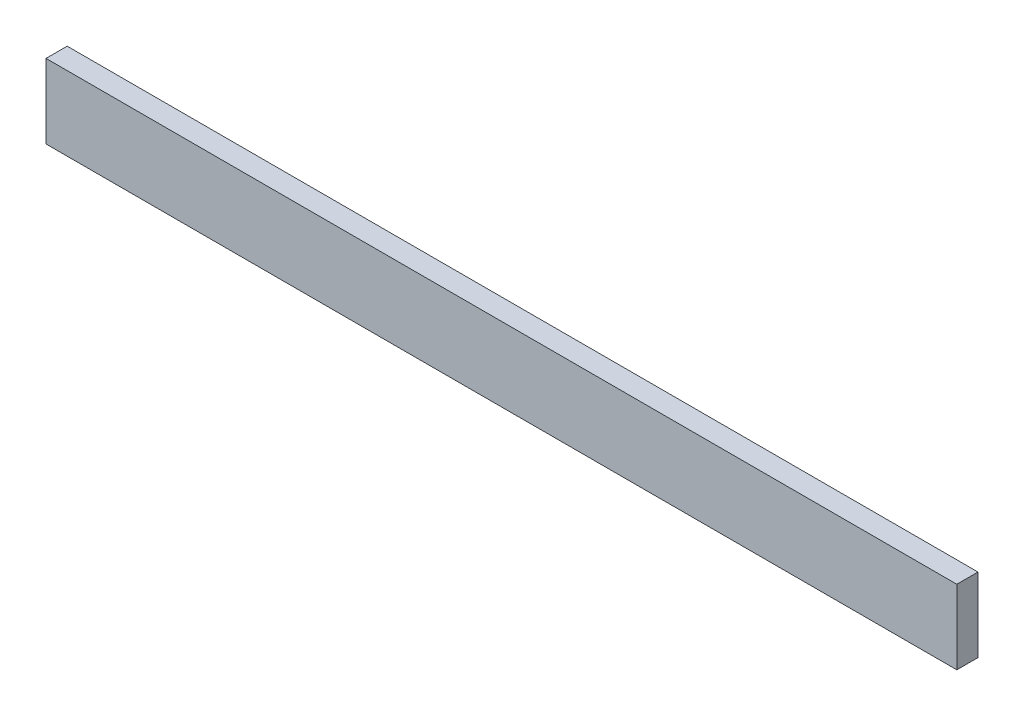
ISO-10303-21;
HEADER;
FILE_DESCRIPTION(('STEP AP214'),'2;1');
FILE_NAME('part.step','',(''),(''),'','','');
FILE_SCHEMA(('AUTOMOTIVE_DESIGN { 1 0 10303 214 1 1 1 1 }'));
ENDSEC;
DATA;
#1=APPLICATION_CONTEXT('core data for automotive mechanical design processes');
#2=APPLICATION_PROTOCOL_DEFINITION('international standard','automotive_design',2000,#1);
#3=PRODUCT_CONTEXT('',#1,'mechanical');
#4=PRODUCT('Part','Part','',(#3));
#5=PRODUCT_RELATED_PRODUCT_CATEGORY('part','',(#4));
#6=PRODUCT_DEFINITION_FORMATION('','',#4);
#7=PRODUCT_DEFINITION_CONTEXT('part definition',#1,'design');
#8=PRODUCT_DEFINITION('design','',#6,#7);
#9=PRODUCT_DEFINITION_SHAPE('','',#8);
#10=(LENGTH_UNIT() NAMED_UNIT(*) SI_UNIT(.MILLI.,.METRE.));
#11=(NAMED_UNIT(*) PLANE_ANGLE_UNIT() SI_UNIT($,.RADIAN.));
#12=(NAMED_UNIT(*) SI_UNIT($,.STERADIAN.) SOLID_ANGLE_UNIT());
#13=UNCERTAINTY_MEASURE_WITH_UNIT(LENGTH_MEASURE(1.E-05),#10,'distance_accuracy_value','');
#14=(GEOMETRIC_REPRESENTATION_CONTEXT(3) GLOBAL_UNCERTAINTY_ASSIGNED_CONTEXT((#13)) GLOBAL_UNIT_ASSIGNED_CONTEXT((#10,
#11,#12)) REPRESENTATION_CONTEXT('',''));
#15=CARTESIAN_POINT('',(0.,0.,0.));
#16=DIRECTION('',(0.,0.,1.));
#17=DIRECTION('',(1.,0.,0.));
#18=AXIS2_PLACEMENT_3D('',#15,#16,#17);
#19=CARTESIAN_POINT('',(85.9999999999999,7.,-4.));
#20=DIRECTION('',(1.,0.,0.));
#21=DIRECTION('',(0.,0.,-1.));
#22=AXIS2_PLACEMENT_3D('',#19,#20,#21);
#23=PLANE('',#22);
#24=DIRECTION('',(0.,1.,0.));
#25=VECTOR('',#24,1.);
#26=CARTESIAN_POINT('',(85.9999999999999,7.,0.));
#27=LINE('',#26,#25);
#28=CARTESIAN_POINT('',(85.9999999999999,-7.,0.));
#29=VERTEX_POINT('',#28);
#30=CARTESIAN_POINT('',(85.9999999999999,7.,0.));
#31=VERTEX_POINT('',#30);
#32=EDGE_CURVE('E101',#29,#31,#27,.T.);
#33=ORIENTED_EDGE('',*,*,#32,.F.);
#34=DIRECTION('',(0.,0.,1.));
#35=VECTOR('',#34,1.);
#36=CARTESIAN_POINT('',(85.9999999999999,-7.,-4.));
#37=LINE('',#36,#35);
#38=CARTESIAN_POINT('',(85.9999999999999,-7.,-4.));
#39=VERTEX_POINT('',#38);
#40=EDGE_CURVE('E11',#39,#29,#37,.T.);
#41=ORIENTED_EDGE('',*,*,#40,.F.);
#42=DIRECTION('',(0.,1.,0.));
#43=VECTOR('',#42,1.);
#44=CARTESIAN_POINT('',(85.9999999999999,7.,-4.));
#45=LINE('',#44,#43);
#46=CARTESIAN_POINT('',(85.9999999999999,7.,-4.));
#47=VERTEX_POINT('',#46);
#48=EDGE_CURVE('E95',#39,#47,#45,.T.);
#49=ORIENTED_EDGE('',*,*,#48,.T.);
#50=DIRECTION('',(0.,0.,1.));
#51=VECTOR('',#50,1.);
#52=CARTESIAN_POINT('',(85.9999999999999,7.,-4.));
#53=LINE('',#52,#51);
#54=EDGE_CURVE('E40',#47,#31,#53,.T.);
#55=ORIENTED_EDGE('',*,*,#54,.T.);
#56=EDGE_LOOP('',(#33,#41,#49,#55));
#57=FACE_BOUND('',#56,.T.);
#58=ADVANCED_FACE('F37',(#57),#23,.T.);
#59=CARTESIAN_POINT('',(-86.,-7.,-4.));
#60=DIRECTION('',(0.,-1.,0.));
#61=DIRECTION('',(0.,0.,-1.));
#62=AXIS2_PLACEMENT_3D('',#59,#60,#61);
#63=PLANE('',#62);
#64=DIRECTION('',(1.,0.,0.));
#65=VECTOR('',#64,1.);
#66=CARTESIAN_POINT('',(-86.,-7.,0.));
#67=LINE('',#66,#65);
#68=CARTESIAN_POINT('',(-86.,-7.,0.));
#69=VERTEX_POINT('',#68);
#70=EDGE_CURVE('E97',#69,#29,#67,.T.);
#71=ORIENTED_EDGE('',*,*,#70,.F.);
#72=DIRECTION('',(0.,0.,1.));
#73=VECTOR('',#72,1.);
#74=CARTESIAN_POINT('',(-86.,-7.,-4.));
#75=LINE('',#74,#73);
#76=CARTESIAN_POINT('',(-86.,-7.,-4.));
#77=VERTEX_POINT('',#76);
#78=EDGE_CURVE('E46',#77,#69,#75,.T.);
#79=ORIENTED_EDGE('',*,*,#78,.F.);
#80=DIRECTION('',(1.,0.,0.));
#81=VECTOR('',#80,1.);
#82=CARTESIAN_POINT('',(-86.,-7.,-4.));
#83=LINE('',#82,#81);
#84=EDGE_CURVE('E92',#77,#39,#83,.T.);
#85=ORIENTED_EDGE('',*,*,#84,.T.);
#86=ORIENTED_EDGE('',*,*,#40,.T.);
#87=EDGE_LOOP('',(#71,#79,#85,#86));
#88=FACE_BOUND('',#87,.T.);
#89=ADVANCED_FACE('F111',(#88),#63,.T.);
#90=CARTESIAN_POINT('',(-86.,7.,-4.));
#91=DIRECTION('',(-1.,0.,0.));
#92=DIRECTION('',(0.,0.,1.));
#93=AXIS2_PLACEMENT_3D('',#90,#91,#92);
#94=PLANE('',#93);
#95=DIRECTION('',(0.,-1.,0.));
#96=VECTOR('',#95,1.);
#97=CARTESIAN_POINT('',(-86.,7.,0.));
#98=LINE('',#97,#96);
#99=CARTESIAN_POINT('',(-86.,7.,0.));
#100=VERTEX_POINT('',#99);
#101=EDGE_CURVE('E87',#100,#69,#98,.T.);
#102=ORIENTED_EDGE('',*,*,#101,.F.);
#103=DIRECTION('',(0.,0.,1.));
#104=VECTOR('',#103,1.);
#105=CARTESIAN_POINT('',(-86.,7.,-4.));
#106=LINE('',#105,#104);
#107=CARTESIAN_POINT('',(-86.,7.,-4.));
#108=VERTEX_POINT('',#107);
#109=EDGE_CURVE('E82',#108,#100,#106,.T.);
#110=ORIENTED_EDGE('',*,*,#109,.F.);
#111=DIRECTION('',(0.,-1.,0.));
#112=VECTOR('',#111,1.);
#113=CARTESIAN_POINT('',(-86.,7.,-4.));
#114=LINE('',#113,#112);
#115=EDGE_CURVE('E85',#108,#77,#114,.T.);
#116=ORIENTED_EDGE('',*,*,#115,.T.);
#117=ORIENTED_EDGE('',*,*,#78,.T.);
#118=EDGE_LOOP('',(#102,#110,#116,#117));
#119=FACE_BOUND('',#118,.T.);
#120=ADVANCED_FACE('F84',(#119),#94,.T.);
#121=CARTESIAN_POINT('',(-86.,7.,-4.));
#122=DIRECTION('',(0.,1.,0.));
#123=DIRECTION('',(0.,0.,1.));
#124=AXIS2_PLACEMENT_3D('',#121,#122,#123);
#125=PLANE('',#124);
#126=DIRECTION('',(-1.,0.,0.));
#127=VECTOR('',#126,1.);
#128=CARTESIAN_POINT('',(-86.,7.,0.));
#129=LINE('',#128,#127);
#130=EDGE_CURVE('E104',#31,#100,#129,.T.);
#131=ORIENTED_EDGE('',*,*,#130,.F.);
#132=ORIENTED_EDGE('',*,*,#54,.F.);
#133=DIRECTION('',(-1.,0.,0.));
#134=VECTOR('',#133,1.);
#135=CARTESIAN_POINT('',(-86.,7.,-4.));
#136=LINE('',#135,#134);
#137=EDGE_CURVE('E91',#47,#108,#136,.T.);
#138=ORIENTED_EDGE('',*,*,#137,.T.);
#139=ORIENTED_EDGE('',*,*,#109,.T.);
#140=EDGE_LOOP('',(#131,#132,#138,#139));
#141=FACE_BOUND('',#140,.T.);
#142=ADVANCED_FACE('F94',(#141),#125,.T.);
#143=CARTESIAN_POINT('',(0.,0.,-4.));
#144=DIRECTION('',(0.,0.,1.));
#145=DIRECTION('',(1.,0.,0.));
#146=AXIS2_PLACEMENT_3D('',#143,#144,#145);
#147=PLANE('',#146);
#148=ORIENTED_EDGE('',*,*,#48,.F.);
#149=ORIENTED_EDGE('',*,*,#84,.F.);
#150=ORIENTED_EDGE('',*,*,#115,.F.);
#151=ORIENTED_EDGE('',*,*,#137,.F.);
#152=EDGE_LOOP('',(#148,#149,#150,#151));
#153=FACE_BOUND('',#152,.T.);
#154=ADVANCED_FACE('F90',(#153),#147,.F.);
#155=CARTESIAN_POINT('',(0.,0.,0.));
#156=DIRECTION('',(0.,0.,1.));
#157=DIRECTION('',(1.,0.,0.));
#158=AXIS2_PLACEMENT_3D('',#155,#156,#157);
#159=PLANE('',#158);
#160=ORIENTED_EDGE('',*,*,#32,.T.);
#161=ORIENTED_EDGE('',*,*,#130,.T.);
#162=ORIENTED_EDGE('',*,*,#101,.T.);
#163=ORIENTED_EDGE('',*,*,#70,.T.);
#164=EDGE_LOOP('',(#160,#161,#162,#163));
#165=FACE_BOUND('',#164,.T.);
#166=ADVANCED_FACE('F110',(#165),#159,.T.);
#167=CLOSED_SHELL('',(#58,#89,#120,#142,#154,#166));
#168=MANIFOLD_SOLID_BREP('B2',#167);
#169=ADVANCED_BREP_SHAPE_REPRESENTATION('',(#18,#168),#14);
#170=SHAPE_DEFINITION_REPRESENTATION(#9,#169);
ENDSEC;
END-ISO-10303-21;
